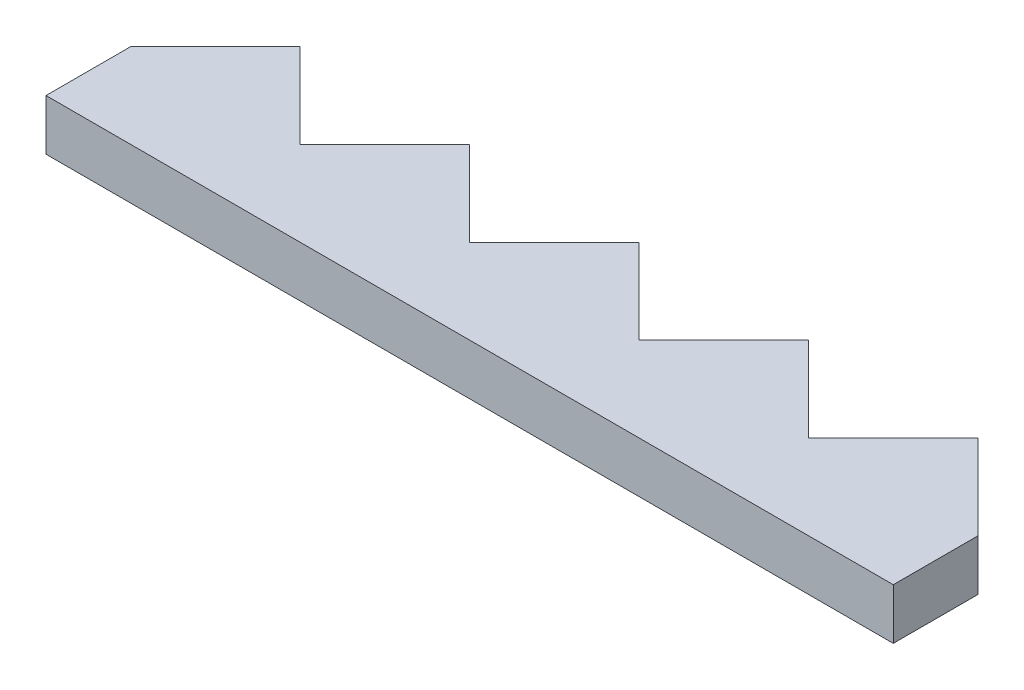
ISO-10303-21;
HEADER;
FILE_DESCRIPTION(('STEP AP214'),'2;1');
FILE_NAME('part.step','',(''),(''),'','','');
FILE_SCHEMA(('AUTOMOTIVE_DESIGN { 1 0 10303 214 1 1 1 1 }'));
ENDSEC;
DATA;
#1=APPLICATION_CONTEXT('core data for automotive mechanical design processes');
#2=APPLICATION_PROTOCOL_DEFINITION('international standard','automotive_design',2000,#1);
#3=PRODUCT_CONTEXT('',#1,'mechanical');
#4=PRODUCT('Part','Part','',(#3));
#5=PRODUCT_RELATED_PRODUCT_CATEGORY('part','',(#4));
#6=PRODUCT_DEFINITION_FORMATION('','',#4);
#7=PRODUCT_DEFINITION_CONTEXT('part definition',#1,'design');
#8=PRODUCT_DEFINITION('design','',#6,#7);
#9=PRODUCT_DEFINITION_SHAPE('','',#8);
#10=(LENGTH_UNIT() NAMED_UNIT(*) SI_UNIT(.MILLI.,.METRE.));
#11=(NAMED_UNIT(*) PLANE_ANGLE_UNIT() SI_UNIT($,.RADIAN.));
#12=(NAMED_UNIT(*) SI_UNIT($,.STERADIAN.) SOLID_ANGLE_UNIT());
#13=UNCERTAINTY_MEASURE_WITH_UNIT(LENGTH_MEASURE(1.E-05),#10,'distance_accuracy_value','');
#14=(GEOMETRIC_REPRESENTATION_CONTEXT(3) GLOBAL_UNCERTAINTY_ASSIGNED_CONTEXT((#13)) GLOBAL_UNIT_ASSIGNED_CONTEXT((#10,
#11,#12)) REPRESENTATION_CONTEXT('',''));
#15=CARTESIAN_POINT('',(0.,0.,0.));
#16=DIRECTION('',(0.,0.,1.));
#17=DIRECTION('',(1.,0.,0.));
#18=AXIS2_PLACEMENT_3D('',#15,#16,#17);
#19=CARTESIAN_POINT('',(0.,3.,-5.));
#20=DIRECTION('',(1.,0.,0.));
#21=DIRECTION('',(0.,0.,-1.));
#22=AXIS2_PLACEMENT_3D('',#19,#20,#21);
#23=PLANE('',#22);
#24=DIRECTION('',(0.,0.,1.));
#25=VECTOR('',#24,1.);
#26=CARTESIAN_POINT('',(0.,0.,-5.));
#27=LINE('',#26,#25);
#28=CARTESIAN_POINT('',(0.,0.,-5.));
#29=VERTEX_POINT('',#28);
#30=CARTESIAN_POINT('',(0.,0.,0.));
#31=VERTEX_POINT('',#30);
#32=EDGE_CURVE('E159',#29,#31,#27,.T.);
#33=ORIENTED_EDGE('',*,*,#32,.T.);
#34=DIRECTION('',(0.,-1.,0.));
#35=VECTOR('',#34,1.);
#36=CARTESIAN_POINT('',(0.,3.,0.));
#37=LINE('',#36,#35);
#38=CARTESIAN_POINT('',(0.,3.,0.));
#39=VERTEX_POINT('',#38);
#40=EDGE_CURVE('E11',#39,#31,#37,.T.);
#41=ORIENTED_EDGE('',*,*,#40,.F.);
#42=DIRECTION('',(0.,0.,1.));
#43=VECTOR('',#42,1.);
#44=CARTESIAN_POINT('',(0.,3.,-5.));
#45=LINE('',#44,#43);
#46=CARTESIAN_POINT('',(0.,3.,-5.));
#47=VERTEX_POINT('',#46);
#48=EDGE_CURVE('E183',#47,#39,#45,.T.);
#49=ORIENTED_EDGE('',*,*,#48,.F.);
#50=DIRECTION('',(0.,-1.,0.));
#51=VECTOR('',#50,1.);
#52=CARTESIAN_POINT('',(0.,3.,-5.));
#53=LINE('',#52,#51);
#54=EDGE_CURVE('E155',#47,#29,#53,.T.);
#55=ORIENTED_EDGE('',*,*,#54,.T.);
#56=EDGE_LOOP('',(#33,#41,#49,#55));
#57=FACE_BOUND('',#56,.T.);
#58=ADVANCED_FACE('F33',(#57),#23,.F.);
#59=CARTESIAN_POINT('',(0.,3.,0.));
#60=DIRECTION('',(0.,0.,-1.));
#61=DIRECTION('',(-1.,0.,0.));
#62=AXIS2_PLACEMENT_3D('',#59,#60,#61);
#63=PLANE('',#62);
#64=DIRECTION('',(1.,0.,0.));
#65=VECTOR('',#64,1.);
#66=CARTESIAN_POINT('',(0.,0.,0.));
#67=LINE('',#66,#65);
#68=CARTESIAN_POINT('',(50.,0.,0.));
#69=VERTEX_POINT('',#68);
#70=EDGE_CURVE('E162',#31,#69,#67,.T.);
#71=ORIENTED_EDGE('',*,*,#70,.T.);
#72=DIRECTION('',(0.,-1.,0.));
#73=VECTOR('',#72,1.);
#74=CARTESIAN_POINT('',(50.,3.,0.));
#75=LINE('',#74,#73);
#76=CARTESIAN_POINT('',(50.,3.,0.));
#77=VERTEX_POINT('',#76);
#78=EDGE_CURVE('E41',#77,#69,#75,.T.);
#79=ORIENTED_EDGE('',*,*,#78,.F.);
#80=DIRECTION('',(1.,0.,0.));
#81=VECTOR('',#80,1.);
#82=CARTESIAN_POINT('',(0.,3.,0.));
#83=LINE('',#82,#81);
#84=EDGE_CURVE('E107',#39,#77,#83,.T.);
#85=ORIENTED_EDGE('',*,*,#84,.F.);
#86=ORIENTED_EDGE('',*,*,#40,.T.);
#87=EDGE_LOOP('',(#71,#79,#85,#86));
#88=FACE_BOUND('',#87,.T.);
#89=ADVANCED_FACE('F266',(#88),#63,.F.);
#90=CARTESIAN_POINT('',(50.,3.,-5.));
#91=DIRECTION('',(-1.,0.,0.));
#92=DIRECTION('',(0.,0.,1.));
#93=AXIS2_PLACEMENT_3D('',#90,#91,#92);
#94=PLANE('',#93);
#95=DIRECTION('',(0.,0.,-1.));
#96=VECTOR('',#95,1.);
#97=CARTESIAN_POINT('',(50.,0.,-5.));
#98=LINE('',#97,#96);
#99=CARTESIAN_POINT('',(50.,0.,-5.));
#100=VERTEX_POINT('',#99);
#101=EDGE_CURVE('E164',#69,#100,#98,.T.);
#102=ORIENTED_EDGE('',*,*,#101,.T.);
#103=DIRECTION('',(0.,-1.,0.));
#104=VECTOR('',#103,1.);
#105=CARTESIAN_POINT('',(50.,3.,-5.));
#106=LINE('',#105,#104);
#107=CARTESIAN_POINT('',(50.,3.,-5.));
#108=VERTEX_POINT('',#107);
#109=EDGE_CURVE('E205',#108,#100,#106,.T.);
#110=ORIENTED_EDGE('',*,*,#109,.F.);
#111=DIRECTION('',(0.,0.,-1.));
#112=VECTOR('',#111,1.);
#113=CARTESIAN_POINT('',(50.,3.,-5.));
#114=LINE('',#113,#112);
#115=EDGE_CURVE('E213',#77,#108,#114,.T.);
#116=ORIENTED_EDGE('',*,*,#115,.F.);
#117=ORIENTED_EDGE('',*,*,#78,.T.);
#118=EDGE_LOOP('',(#102,#110,#116,#117));
#119=FACE_BOUND('',#118,.T.);
#120=ADVANCED_FACE('F211',(#119),#94,.F.);
#121=CARTESIAN_POINT('',(45.,3.,-10.));
#122=DIRECTION('',(-0.707106781186547,0.,0.707106781186548));
#123=DIRECTION('',(0.707106781186548,0.,0.707106781186547));
#124=AXIS2_PLACEMENT_3D('',#121,#122,#123);
#125=PLANE('',#124);
#126=DIRECTION('',(-0.707106781186548,0.,-0.707106781186547));
#127=VECTOR('',#126,1.);
#128=CARTESIAN_POINT('',(45.,0.,-10.));
#129=LINE('',#128,#127);
#130=CARTESIAN_POINT('',(45.,0.,-10.));
#131=VERTEX_POINT('',#130);
#132=EDGE_CURVE('E166',#100,#131,#129,.T.);
#133=ORIENTED_EDGE('',*,*,#132,.T.);
#134=DIRECTION('',(0.,-1.,0.));
#135=VECTOR('',#134,1.);
#136=CARTESIAN_POINT('',(45.,3.,-10.));
#137=LINE('',#136,#135);
#138=CARTESIAN_POINT('',(45.,3.,-10.));
#139=VERTEX_POINT('',#138);
#140=EDGE_CURVE('E202',#139,#131,#137,.T.);
#141=ORIENTED_EDGE('',*,*,#140,.F.);
#142=DIRECTION('',(-0.707106781186548,0.,-0.707106781186547));
#143=VECTOR('',#142,1.);
#144=CARTESIAN_POINT('',(45.,3.,-10.));
#145=LINE('',#144,#143);
#146=EDGE_CURVE('E231',#108,#139,#145,.T.);
#147=ORIENTED_EDGE('',*,*,#146,.F.);
#148=ORIENTED_EDGE('',*,*,#109,.T.);
#149=EDGE_LOOP('',(#133,#141,#147,#148));
#150=FACE_BOUND('',#149,.T.);
#151=ADVANCED_FACE('F222',(#150),#125,.F.);
#152=CARTESIAN_POINT('',(40.,3.,-5.));
#153=DIRECTION('',(0.707106781186548,0.,0.707106781186547));
#154=DIRECTION('',(0.707106781186547,0.,-0.707106781186548));
#155=AXIS2_PLACEMENT_3D('',#152,#153,#154);
#156=PLANE('',#155);
#157=DIRECTION('',(-0.707106781186547,0.,0.707106781186548));
#158=VECTOR('',#157,1.);
#159=CARTESIAN_POINT('',(40.,0.,-5.));
#160=LINE('',#159,#158);
#161=CARTESIAN_POINT('',(40.,0.,-5.));
#162=VERTEX_POINT('',#161);
#163=EDGE_CURVE('E168',#131,#162,#160,.T.);
#164=ORIENTED_EDGE('',*,*,#163,.T.);
#165=DIRECTION('',(0.,-1.,0.));
#166=VECTOR('',#165,1.);
#167=CARTESIAN_POINT('',(40.,3.,-5.));
#168=LINE('',#167,#166);
#169=CARTESIAN_POINT('',(40.,3.,-5.));
#170=VERTEX_POINT('',#169);
#171=EDGE_CURVE('E199',#170,#162,#168,.T.);
#172=ORIENTED_EDGE('',*,*,#171,.F.);
#173=DIRECTION('',(-0.707106781186547,0.,0.707106781186548));
#174=VECTOR('',#173,1.);
#175=CARTESIAN_POINT('',(40.,3.,-5.));
#176=LINE('',#175,#174);
#177=EDGE_CURVE('E228',#139,#170,#176,.T.);
#178=ORIENTED_EDGE('',*,*,#177,.F.);
#179=ORIENTED_EDGE('',*,*,#140,.T.);
#180=EDGE_LOOP('',(#164,#172,#178,#179));
#181=FACE_BOUND('',#180,.T.);
#182=ADVANCED_FACE('F226',(#181),#156,.F.);
#183=CARTESIAN_POINT('',(35.,3.,-10.));
#184=DIRECTION('',(-0.707106781186547,0.,0.707106781186548));
#185=DIRECTION('',(0.707106781186548,0.,0.707106781186547));
#186=AXIS2_PLACEMENT_3D('',#183,#184,#185);
#187=PLANE('',#186);
#188=DIRECTION('',(-0.707106781186548,0.,-0.707106781186547));
#189=VECTOR('',#188,1.);
#190=CARTESIAN_POINT('',(35.,0.,-10.));
#191=LINE('',#190,#189);
#192=CARTESIAN_POINT('',(35.,0.,-10.));
#193=VERTEX_POINT('',#192);
#194=EDGE_CURVE('E170',#162,#193,#191,.T.);
#195=ORIENTED_EDGE('',*,*,#194,.T.);
#196=DIRECTION('',(0.,-1.,0.));
#197=VECTOR('',#196,1.);
#198=CARTESIAN_POINT('',(35.,3.,-10.));
#199=LINE('',#198,#197);
#200=CARTESIAN_POINT('',(35.,3.,-10.));
#201=VERTEX_POINT('',#200);
#202=EDGE_CURVE('E196',#201,#193,#199,.T.);
#203=ORIENTED_EDGE('',*,*,#202,.F.);
#204=DIRECTION('',(-0.707106781186548,0.,-0.707106781186547));
#205=VECTOR('',#204,1.);
#206=CARTESIAN_POINT('',(35.,3.,-10.));
#207=LINE('',#206,#205);
#208=EDGE_CURVE('E230',#170,#201,#207,.T.);
#209=ORIENTED_EDGE('',*,*,#208,.F.);
#210=ORIENTED_EDGE('',*,*,#171,.T.);
#211=EDGE_LOOP('',(#195,#203,#209,#210));
#212=FACE_BOUND('',#211,.T.);
#213=ADVANCED_FACE('F279',(#212),#187,.F.);
#214=CARTESIAN_POINT('',(30.,3.,-5.));
#215=DIRECTION('',(0.707106781186548,0.,0.707106781186547));
#216=DIRECTION('',(0.707106781186547,0.,-0.707106781186548));
#217=AXIS2_PLACEMENT_3D('',#214,#215,#216);
#218=PLANE('',#217);
#219=DIRECTION('',(-0.707106781186547,0.,0.707106781186548));
#220=VECTOR('',#219,1.);
#221=CARTESIAN_POINT('',(30.,0.,-5.));
#222=LINE('',#221,#220);
#223=CARTESIAN_POINT('',(30.,0.,-5.));
#224=VERTEX_POINT('',#223);
#225=EDGE_CURVE('E172',#193,#224,#222,.T.);
#226=ORIENTED_EDGE('',*,*,#225,.T.);
#227=DIRECTION('',(0.,-1.,0.));
#228=VECTOR('',#227,1.);
#229=CARTESIAN_POINT('',(30.,3.,-5.));
#230=LINE('',#229,#228);
#231=CARTESIAN_POINT('',(30.,3.,-5.));
#232=VERTEX_POINT('',#231);
#233=EDGE_CURVE('E193',#232,#224,#230,.T.);
#234=ORIENTED_EDGE('',*,*,#233,.F.);
#235=DIRECTION('',(-0.707106781186547,0.,0.707106781186548));
#236=VECTOR('',#235,1.);
#237=CARTESIAN_POINT('',(30.,3.,-5.));
#238=LINE('',#237,#236);
#239=EDGE_CURVE('E233',#201,#232,#238,.T.);
#240=ORIENTED_EDGE('',*,*,#239,.F.);
#241=ORIENTED_EDGE('',*,*,#202,.T.);
#242=EDGE_LOOP('',(#226,#234,#240,#241));
#243=FACE_BOUND('',#242,.T.);
#244=ADVANCED_FACE('F282',(#243),#218,.F.);
#245=CARTESIAN_POINT('',(25.,3.,-10.));
#246=DIRECTION('',(-0.707106781186548,0.,0.707106781186547));
#247=DIRECTION('',(0.707106781186547,0.,0.707106781186548));
#248=AXIS2_PLACEMENT_3D('',#245,#246,#247);
#249=PLANE('',#248);
#250=DIRECTION('',(-0.707106781186547,0.,-0.707106781186548));
#251=VECTOR('',#250,1.);
#252=CARTESIAN_POINT('',(25.,0.,-10.));
#253=LINE('',#252,#251);
#254=CARTESIAN_POINT('',(25.,0.,-10.));
#255=VERTEX_POINT('',#254);
#256=EDGE_CURVE('E174',#224,#255,#253,.T.);
#257=ORIENTED_EDGE('',*,*,#256,.T.);
#258=DIRECTION('',(0.,-1.,0.));
#259=VECTOR('',#258,1.);
#260=CARTESIAN_POINT('',(25.,3.,-10.));
#261=LINE('',#260,#259);
#262=CARTESIAN_POINT('',(25.,3.,-10.));
#263=VERTEX_POINT('',#262);
#264=EDGE_CURVE('E190',#263,#255,#261,.T.);
#265=ORIENTED_EDGE('',*,*,#264,.F.);
#266=DIRECTION('',(-0.707106781186547,0.,-0.707106781186548));
#267=VECTOR('',#266,1.);
#268=CARTESIAN_POINT('',(25.,3.,-10.));
#269=LINE('',#268,#267);
#270=EDGE_CURVE('E239',#232,#263,#269,.T.);
#271=ORIENTED_EDGE('',*,*,#270,.F.);
#272=ORIENTED_EDGE('',*,*,#233,.T.);
#273=EDGE_LOOP('',(#257,#265,#271,#272));
#274=FACE_BOUND('',#273,.T.);
#275=ADVANCED_FACE('F286',(#274),#249,.F.);
#276=CARTESIAN_POINT('',(20.,3.,-5.));
#277=DIRECTION('',(0.707106781186547,0.,0.707106781186548));
#278=DIRECTION('',(0.707106781186548,0.,-0.707106781186547));
#279=AXIS2_PLACEMENT_3D('',#276,#277,#278);
#280=PLANE('',#279);
#281=DIRECTION('',(-0.707106781186548,0.,0.707106781186547));
#282=VECTOR('',#281,1.);
#283=CARTESIAN_POINT('',(20.,0.,-5.));
#284=LINE('',#283,#282);
#285=CARTESIAN_POINT('',(20.,0.,-5.));
#286=VERTEX_POINT('',#285);
#287=EDGE_CURVE('E176',#255,#286,#284,.T.);
#288=ORIENTED_EDGE('',*,*,#287,.T.);
#289=DIRECTION('',(0.,-1.,0.));
#290=VECTOR('',#289,1.);
#291=CARTESIAN_POINT('',(20.,3.,-5.));
#292=LINE('',#291,#290);
#293=CARTESIAN_POINT('',(20.,3.,-5.));
#294=VERTEX_POINT('',#293);
#295=EDGE_CURVE('E187',#294,#286,#292,.T.);
#296=ORIENTED_EDGE('',*,*,#295,.F.);
#297=DIRECTION('',(-0.707106781186548,0.,0.707106781186547));
#298=VECTOR('',#297,1.);
#299=CARTESIAN_POINT('',(20.,3.,-5.));
#300=LINE('',#299,#298);
#301=EDGE_CURVE('E241',#263,#294,#300,.T.);
#302=ORIENTED_EDGE('',*,*,#301,.F.);
#303=ORIENTED_EDGE('',*,*,#264,.T.);
#304=EDGE_LOOP('',(#288,#296,#302,#303));
#305=FACE_BOUND('',#304,.T.);
#306=ADVANCED_FACE('F247',(#305),#280,.F.);
#307=CARTESIAN_POINT('',(15.,3.,-10.));
#308=DIRECTION('',(-0.707106781186547,0.,0.707106781186548));
#309=DIRECTION('',(0.707106781186548,0.,0.707106781186547));
#310=AXIS2_PLACEMENT_3D('',#307,#308,#309);
#311=PLANE('',#310);
#312=DIRECTION('',(-0.707106781186548,0.,-0.707106781186547));
#313=VECTOR('',#312,1.);
#314=CARTESIAN_POINT('',(15.,0.,-10.));
#315=LINE('',#314,#313);
#316=CARTESIAN_POINT('',(15.,0.,-10.));
#317=VERTEX_POINT('',#316);
#318=EDGE_CURVE('E178',#286,#317,#315,.T.);
#319=ORIENTED_EDGE('',*,*,#318,.T.);
#320=DIRECTION('',(0.,-1.,0.));
#321=VECTOR('',#320,1.);
#322=CARTESIAN_POINT('',(15.,3.,-10.));
#323=LINE('',#322,#321);
#324=CARTESIAN_POINT('',(15.,3.,-10.));
#325=VERTEX_POINT('',#324);
#326=EDGE_CURVE('E150',#325,#317,#323,.T.);
#327=ORIENTED_EDGE('',*,*,#326,.F.);
#328=DIRECTION('',(-0.707106781186548,0.,-0.707106781186547));
#329=VECTOR('',#328,1.);
#330=CARTESIAN_POINT('',(15.,3.,-10.));
#331=LINE('',#330,#329);
#332=EDGE_CURVE('E141',#294,#325,#331,.T.);
#333=ORIENTED_EDGE('',*,*,#332,.F.);
#334=ORIENTED_EDGE('',*,*,#295,.T.);
#335=EDGE_LOOP('',(#319,#327,#333,#334));
#336=FACE_BOUND('',#335,.T.);
#337=ADVANCED_FACE('F251',(#336),#311,.F.);
#338=CARTESIAN_POINT('',(10.,3.,-5.));
#339=DIRECTION('',(0.707106781186547,0.,0.707106781186547));
#340=DIRECTION('',(0.707106781186548,0.,-0.707106781186548));
#341=AXIS2_PLACEMENT_3D('',#338,#339,#340);
#342=PLANE('',#341);
#343=DIRECTION('',(-0.707106781186548,0.,0.707106781186548));
#344=VECTOR('',#343,1.);
#345=CARTESIAN_POINT('',(10.,0.,-5.));
#346=LINE('',#345,#344);
#347=CARTESIAN_POINT('',(10.,0.,-5.));
#348=VERTEX_POINT('',#347);
#349=EDGE_CURVE('E149',#317,#348,#346,.T.);
#350=ORIENTED_EDGE('',*,*,#349,.T.);
#351=DIRECTION('',(0.,-1.,0.));
#352=VECTOR('',#351,1.);
#353=CARTESIAN_POINT('',(10.,3.,-5.));
#354=LINE('',#353,#352);
#355=CARTESIAN_POINT('',(10.,3.,-5.));
#356=VERTEX_POINT('',#355);
#357=EDGE_CURVE('E146',#356,#348,#354,.T.);
#358=ORIENTED_EDGE('',*,*,#357,.F.);
#359=DIRECTION('',(-0.707106781186548,0.,0.707106781186548));
#360=VECTOR('',#359,1.);
#361=CARTESIAN_POINT('',(10.,3.,-5.));
#362=LINE('',#361,#360);
#363=EDGE_CURVE('E135',#325,#356,#362,.T.);
#364=ORIENTED_EDGE('',*,*,#363,.F.);
#365=ORIENTED_EDGE('',*,*,#326,.T.);
#366=EDGE_LOOP('',(#350,#358,#364,#365));
#367=FACE_BOUND('',#366,.T.);
#368=ADVANCED_FACE('F147',(#367),#342,.F.);
#369=CARTESIAN_POINT('',(5.,3.,-10.));
#370=DIRECTION('',(-0.707106781186547,0.,0.707106781186548));
#371=DIRECTION('',(0.707106781186548,0.,0.707106781186547));
#372=AXIS2_PLACEMENT_3D('',#369,#370,#371);
#373=PLANE('',#372);
#374=DIRECTION('',(-0.707106781186548,0.,-0.707106781186547));
#375=VECTOR('',#374,1.);
#376=CARTESIAN_POINT('',(5.,0.,-10.));
#377=LINE('',#376,#375);
#378=CARTESIAN_POINT('',(5.,0.,-10.));
#379=VERTEX_POINT('',#378);
#380=EDGE_CURVE('E93',#348,#379,#377,.T.);
#381=ORIENTED_EDGE('',*,*,#380,.T.);
#382=DIRECTION('',(0.,-1.,0.));
#383=VECTOR('',#382,1.);
#384=CARTESIAN_POINT('',(5.,3.,-10.));
#385=LINE('',#384,#383);
#386=CARTESIAN_POINT('',(5.,3.,-10.));
#387=VERTEX_POINT('',#386);
#388=EDGE_CURVE('E151',#387,#379,#385,.T.);
#389=ORIENTED_EDGE('',*,*,#388,.F.);
#390=DIRECTION('',(-0.707106781186548,0.,-0.707106781186547));
#391=VECTOR('',#390,1.);
#392=CARTESIAN_POINT('',(5.,3.,-10.));
#393=LINE('',#392,#391);
#394=EDGE_CURVE('E139',#356,#387,#393,.T.);
#395=ORIENTED_EDGE('',*,*,#394,.F.);
#396=ORIENTED_EDGE('',*,*,#357,.T.);
#397=EDGE_LOOP('',(#381,#389,#395,#396));
#398=FACE_BOUND('',#397,.T.);
#399=ADVANCED_FACE('F153',(#398),#373,.F.);
#400=CARTESIAN_POINT('',(0.,3.,-5.));
#401=DIRECTION('',(0.707106781186548,0.,0.707106781186547));
#402=DIRECTION('',(0.707106781186547,0.,-0.707106781186548));
#403=AXIS2_PLACEMENT_3D('',#400,#401,#402);
#404=PLANE('',#403);
#405=DIRECTION('',(-0.707106781186547,0.,0.707106781186548));
#406=VECTOR('',#405,1.);
#407=CARTESIAN_POINT('',(0.,0.,-5.));
#408=LINE('',#407,#406);
#409=EDGE_CURVE('E99',#379,#29,#408,.T.);
#410=ORIENTED_EDGE('',*,*,#409,.T.);
#411=ORIENTED_EDGE('',*,*,#54,.F.);
#412=DIRECTION('',(-0.707106781186547,0.,0.707106781186548));
#413=VECTOR('',#412,1.);
#414=CARTESIAN_POINT('',(0.,3.,-5.));
#415=LINE('',#414,#413);
#416=EDGE_CURVE('E49',#387,#47,#415,.T.);
#417=ORIENTED_EDGE('',*,*,#416,.F.);
#418=ORIENTED_EDGE('',*,*,#388,.T.);
#419=EDGE_LOOP('',(#410,#411,#417,#418));
#420=FACE_BOUND('',#419,.T.);
#421=ADVANCED_FACE('F255',(#420),#404,.F.);
#422=CARTESIAN_POINT('',(0.,3.,0.));
#423=DIRECTION('',(0.,1.,0.));
#424=DIRECTION('',(0.,0.,1.));
#425=AXIS2_PLACEMENT_3D('',#422,#423,#424);
#426=PLANE('',#425);
#427=ORIENTED_EDGE('',*,*,#48,.T.);
#428=ORIENTED_EDGE('',*,*,#84,.T.);
#429=ORIENTED_EDGE('',*,*,#115,.T.);
#430=ORIENTED_EDGE('',*,*,#146,.T.);
#431=ORIENTED_EDGE('',*,*,#177,.T.);
#432=ORIENTED_EDGE('',*,*,#208,.T.);
#433=ORIENTED_EDGE('',*,*,#239,.T.);
#434=ORIENTED_EDGE('',*,*,#270,.T.);
#435=ORIENTED_EDGE('',*,*,#301,.T.);
#436=ORIENTED_EDGE('',*,*,#332,.T.);
#437=ORIENTED_EDGE('',*,*,#363,.T.);
#438=ORIENTED_EDGE('',*,*,#394,.T.);
#439=ORIENTED_EDGE('',*,*,#416,.T.);
#440=EDGE_LOOP('',(#427,#428,#429,#430,#431,#432,#433,#434,#435,#436,#437,#438,#439));
#441=FACE_BOUND('',#440,.T.);
#442=ADVANCED_FACE('F137',(#441),#426,.T.);
#443=CARTESIAN_POINT('',(0.,0.,0.));
#444=DIRECTION('',(0.,1.,0.));
#445=DIRECTION('',(0.,0.,1.));
#446=AXIS2_PLACEMENT_3D('',#443,#444,#445);
#447=PLANE('',#446);
#448=ORIENTED_EDGE('',*,*,#32,.F.);
#449=ORIENTED_EDGE('',*,*,#409,.F.);
#450=ORIENTED_EDGE('',*,*,#380,.F.);
#451=ORIENTED_EDGE('',*,*,#349,.F.);
#452=ORIENTED_EDGE('',*,*,#318,.F.);
#453=ORIENTED_EDGE('',*,*,#287,.F.);
#454=ORIENTED_EDGE('',*,*,#256,.F.);
#455=ORIENTED_EDGE('',*,*,#225,.F.);
#456=ORIENTED_EDGE('',*,*,#194,.F.);
#457=ORIENTED_EDGE('',*,*,#163,.F.);
#458=ORIENTED_EDGE('',*,*,#132,.F.);
#459=ORIENTED_EDGE('',*,*,#101,.F.);
#460=ORIENTED_EDGE('',*,*,#70,.F.);
#461=EDGE_LOOP('',(#448,#449,#450,#451,#452,#453,#454,#455,#456,#457,#458,#459,#460));
#462=FACE_BOUND('',#461,.T.);
#463=ADVANCED_FACE('F217',(#462),#447,.F.);
#464=CLOSED_SHELL('',(#58,#89,#120,#151,#182,#213,#244,#275,#306,#337,#368,#399,#421,#442,#463));
#465=MANIFOLD_SOLID_BREP('B2',#464);
#466=ADVANCED_BREP_SHAPE_REPRESENTATION('',(#18,#465),#14);
#467=SHAPE_DEFINITION_REPRESENTATION(#9,#466);
ENDSEC;
END-ISO-10303-21;
